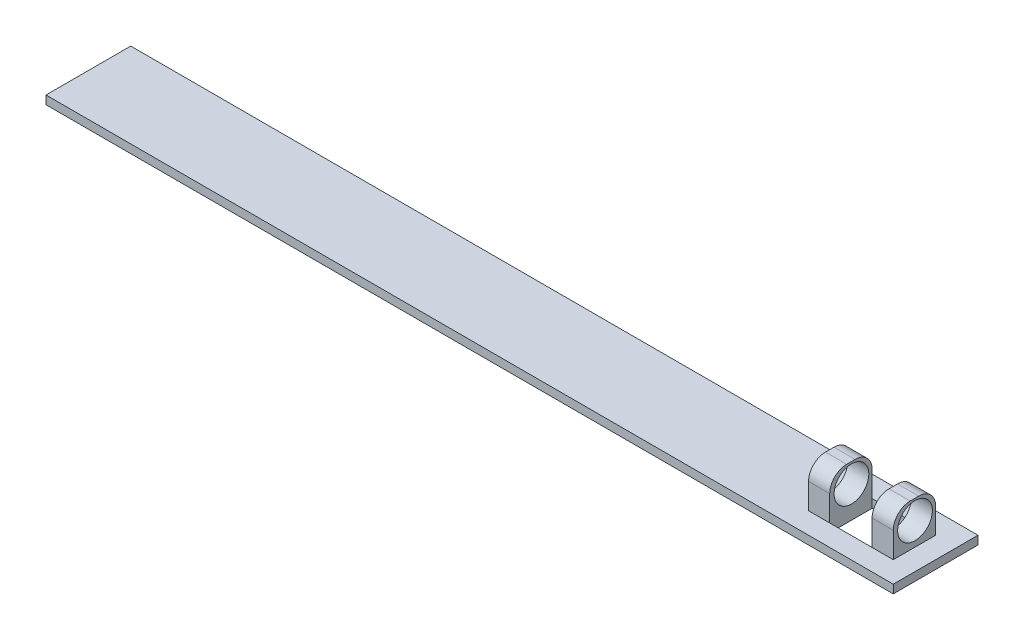
ISO-10303-21;
HEADER;
FILE_DESCRIPTION(('STEP AP214'),'2;1');
FILE_NAME('part.step','',(''),(''),'','','');
FILE_SCHEMA(('AUTOMOTIVE_DESIGN { 1 0 10303 214 1 1 1 1 }'));
ENDSEC;
DATA;
#1=APPLICATION_CONTEXT('core data for automotive mechanical design processes');
#2=APPLICATION_PROTOCOL_DEFINITION('international standard','automotive_design',2000,#1);
#3=PRODUCT_CONTEXT('',#1,'mechanical');
#4=PRODUCT('Part','Part','',(#3));
#5=PRODUCT_RELATED_PRODUCT_CATEGORY('part','',(#4));
#6=PRODUCT_DEFINITION_FORMATION('','',#4);
#7=PRODUCT_DEFINITION_CONTEXT('part definition',#1,'design');
#8=PRODUCT_DEFINITION('design','',#6,#7);
#9=PRODUCT_DEFINITION_SHAPE('','',#8);
#10=(LENGTH_UNIT() NAMED_UNIT(*) SI_UNIT(.MILLI.,.METRE.));
#11=(NAMED_UNIT(*) PLANE_ANGLE_UNIT() SI_UNIT($,.RADIAN.));
#12=(NAMED_UNIT(*) SI_UNIT($,.STERADIAN.) SOLID_ANGLE_UNIT());
#13=UNCERTAINTY_MEASURE_WITH_UNIT(LENGTH_MEASURE(1.E-05),#10,'distance_accuracy_value','');
#14=(GEOMETRIC_REPRESENTATION_CONTEXT(3) GLOBAL_UNCERTAINTY_ASSIGNED_CONTEXT((#13)) GLOBAL_UNIT_ASSIGNED_CONTEXT((#10,
#11,#12)) REPRESENTATION_CONTEXT('',''));
#15=CARTESIAN_POINT('',(0.,0.,0.));
#16=DIRECTION('',(0.,0.,1.));
#17=DIRECTION('',(1.,0.,0.));
#18=AXIS2_PLACEMENT_3D('',#15,#16,#17);
#19=CARTESIAN_POINT('',(0.,0.,0.));
#20=DIRECTION('',(0.,1.,0.));
#21=DIRECTION('',(0.,0.,1.));
#22=AXIS2_PLACEMENT_3D('',#19,#20,#21);
#23=PLANE('',#22);
#24=DIRECTION('',(1.,0.,0.));
#25=VECTOR('',#24,1.);
#26=CARTESIAN_POINT('',(0.,0.,0.));
#27=LINE('',#26,#25);
#28=CARTESIAN_POINT('',(0.,0.,0.));
#29=VERTEX_POINT('',#28);
#30=CARTESIAN_POINT('',(100.,0.,0.));
#31=VERTEX_POINT('',#30);
#32=EDGE_CURVE('E233',#29,#31,#27,.T.);
#33=ORIENTED_EDGE('',*,*,#32,.T.);
#34=DIRECTION('',(0.,0.,-1.));
#35=VECTOR('',#34,1.);
#36=CARTESIAN_POINT('',(100.,0.,0.));
#37=LINE('',#36,#35);
#38=CARTESIAN_POINT('',(100.,0.,-10.));
#39=VERTEX_POINT('',#38);
#40=EDGE_CURVE('E236',#31,#39,#37,.T.);
#41=ORIENTED_EDGE('',*,*,#40,.T.);
#42=DIRECTION('',(1.,0.,0.));
#43=VECTOR('',#42,1.);
#44=CARTESIAN_POINT('',(0.,0.,-10.));
#45=LINE('',#44,#43);
#46=CARTESIAN_POINT('',(0.,0.,-10.));
#47=VERTEX_POINT('',#46);
#48=EDGE_CURVE('E239',#47,#39,#45,.T.);
#49=ORIENTED_EDGE('',*,*,#48,.F.);
#50=DIRECTION('',(0.,0.,-1.));
#51=VECTOR('',#50,1.);
#52=CARTESIAN_POINT('',(0.,0.,0.));
#53=LINE('',#52,#51);
#54=EDGE_CURVE('E211',#29,#47,#53,.T.);
#55=ORIENTED_EDGE('',*,*,#54,.F.);
#56=EDGE_LOOP('',(#33,#41,#49,#55));
#57=FACE_BOUND('',#56,.T.);
#58=DIRECTION('',(0.,0.,-1.));
#59=VECTOR('',#58,1.);
#60=CARTESIAN_POINT('',(97.5,0.,0.));
#61=LINE('',#60,#59);
#62=CARTESIAN_POINT('',(97.5,0.,-2.5));
#63=VERTEX_POINT('',#62);
#64=CARTESIAN_POINT('',(97.5,0.,-7.5));
#65=VERTEX_POINT('',#64);
#66=EDGE_CURVE('E184',#63,#65,#61,.T.);
#67=ORIENTED_EDGE('',*,*,#66,.F.);
#68=DIRECTION('',(1.,0.,0.));
#69=VECTOR('',#68,1.);
#70=CARTESIAN_POINT('',(0.,0.,-2.5));
#71=LINE('',#70,#69);
#72=CARTESIAN_POINT('',(95.,0.,-2.5));
#73=VERTEX_POINT('',#72);
#74=EDGE_CURVE('E168',#73,#63,#71,.T.);
#75=ORIENTED_EDGE('',*,*,#74,.F.);
#76=DIRECTION('',(1.,0.,0.));
#77=VECTOR('',#76,1.);
#78=CARTESIAN_POINT('',(0.,0.,-2.5));
#79=LINE('',#78,#77);
#80=CARTESIAN_POINT('',(90.,0.,-2.5));
#81=VERTEX_POINT('',#80);
#82=EDGE_CURVE('E181',#81,#73,#79,.T.);
#83=ORIENTED_EDGE('',*,*,#82,.F.);
#84=CARTESIAN_POINT('',(87.5,0.,-2.5));
#85=VERTEX_POINT('',#84);
#86=EDGE_CURVE('E195',#85,#81,#79,.T.);
#87=ORIENTED_EDGE('',*,*,#86,.F.);
#88=DIRECTION('',(0.,0.,-1.));
#89=VECTOR('',#88,1.);
#90=CARTESIAN_POINT('',(87.5,0.,0.));
#91=LINE('',#90,#89);
#92=CARTESIAN_POINT('',(87.5,0.,-7.5));
#93=VERTEX_POINT('',#92);
#94=EDGE_CURVE('E226',#85,#93,#91,.T.);
#95=ORIENTED_EDGE('',*,*,#94,.T.);
#96=DIRECTION('',(1.,0.,0.));
#97=VECTOR('',#96,1.);
#98=CARTESIAN_POINT('',(0.,0.,-7.5));
#99=LINE('',#98,#97);
#100=CARTESIAN_POINT('',(90.,0.,-7.5));
#101=VERTEX_POINT('',#100);
#102=EDGE_CURVE('E230',#93,#101,#99,.T.);
#103=ORIENTED_EDGE('',*,*,#102,.T.);
#104=CARTESIAN_POINT('',(95.,0.,-7.5));
#105=VERTEX_POINT('',#104);
#106=EDGE_CURVE('E229',#101,#105,#99,.T.);
#107=ORIENTED_EDGE('',*,*,#106,.T.);
#108=DIRECTION('',(1.,0.,0.));
#109=VECTOR('',#108,1.);
#110=CARTESIAN_POINT('',(0.,0.,-7.5));
#111=LINE('',#110,#109);
#112=EDGE_CURVE('E323',#105,#65,#111,.T.);
#113=ORIENTED_EDGE('',*,*,#112,.T.);
#114=EDGE_LOOP('',(#67,#75,#83,#87,#95,#103,#107,#113));
#115=FACE_BOUND('',#114,.T.);
#116=ADVANCED_FACE('F38',(#57,#115),#23,.T.);
#117=CARTESIAN_POINT('',(0.,-1.,-7.5));
#118=DIRECTION('',(0.,0.,1.));
#119=DIRECTION('',(1.,0.,0.));
#120=AXIS2_PLACEMENT_3D('',#117,#118,#119);
#121=PLANE('',#120);
#122=DIRECTION('',(1.,0.,0.));
#123=VECTOR('',#122,1.);
#124=CARTESIAN_POINT('',(0.,-1.,-7.5));
#125=LINE('',#124,#123);
#126=CARTESIAN_POINT('',(90.,-1.,-7.5));
#127=VERTEX_POINT('',#126);
#128=CARTESIAN_POINT('',(95.,-1.,-7.5));
#129=VERTEX_POINT('',#128);
#130=EDGE_CURVE('E210',#127,#129,#125,.T.);
#131=ORIENTED_EDGE('',*,*,#130,.T.);
#132=DIRECTION('',(0.,1.,0.));
#133=VECTOR('',#132,1.);
#134=CARTESIAN_POINT('',(95.,-1.,-7.5));
#135=LINE('',#134,#133);
#136=EDGE_CURVE('E196',#129,#105,#135,.T.);
#137=ORIENTED_EDGE('',*,*,#136,.T.);
#138=ORIENTED_EDGE('',*,*,#106,.F.);
#139=DIRECTION('',(0.,1.,0.));
#140=VECTOR('',#139,1.);
#141=CARTESIAN_POINT('',(90.,5.,-7.5));
#142=LINE('',#141,#140);
#143=EDGE_CURVE('E253',#127,#101,#142,.T.);
#144=ORIENTED_EDGE('',*,*,#143,.F.);
#145=EDGE_LOOP('',(#131,#137,#138,#144));
#146=FACE_BOUND('',#145,.T.);
#147=ADVANCED_FACE('F326',(#146),#121,.T.);
#148=CARTESIAN_POINT('',(0.,-1.,-2.5));
#149=DIRECTION('',(0.,0.,1.));
#150=DIRECTION('',(1.,0.,0.));
#151=AXIS2_PLACEMENT_3D('',#148,#149,#150);
#152=PLANE('',#151);
#153=DIRECTION('',(0.,1.,0.));
#154=VECTOR('',#153,1.);
#155=CARTESIAN_POINT('',(95.,-1.,-2.5));
#156=LINE('',#155,#154);
#157=CARTESIAN_POINT('',(95.,-1.,-2.5));
#158=VERTEX_POINT('',#157);
#159=EDGE_CURVE('E191',#158,#73,#156,.T.);
#160=ORIENTED_EDGE('',*,*,#159,.F.);
#161=DIRECTION('',(1.,0.,0.));
#162=VECTOR('',#161,1.);
#163=CARTESIAN_POINT('',(0.,-1.,-2.5));
#164=LINE('',#163,#162);
#165=CARTESIAN_POINT('',(90.,-1.,-2.5));
#166=VERTEX_POINT('',#165);
#167=EDGE_CURVE('E208',#166,#158,#164,.T.);
#168=ORIENTED_EDGE('',*,*,#167,.F.);
#169=DIRECTION('',(0.,1.,0.));
#170=VECTOR('',#169,1.);
#171=CARTESIAN_POINT('',(90.,5.,-2.5));
#172=LINE('',#171,#170);
#173=EDGE_CURVE('E194',#166,#81,#172,.T.);
#174=ORIENTED_EDGE('',*,*,#173,.T.);
#175=ORIENTED_EDGE('',*,*,#82,.T.);
#176=EDGE_LOOP('',(#160,#168,#174,#175));
#177=FACE_BOUND('',#176,.T.);
#178=ADVANCED_FACE('F189',(#177),#152,.F.);
#179=CARTESIAN_POINT('',(0.,5.,-2.5));
#180=DIRECTION('',(0.,0.,-1.));
#181=DIRECTION('',(-1.,0.,0.));
#182=AXIS2_PLACEMENT_3D('',#179,#180,#181);
#183=PLANE('',#182);
#184=DIRECTION('',(0.,-1.,0.));
#185=VECTOR('',#184,1.);
#186=CARTESIAN_POINT('',(90.,5.,-2.5));
#187=LINE('',#186,#185);
#188=CARTESIAN_POINT('',(90.,3.,-2.5));
#189=VERTEX_POINT('',#188);
#190=EDGE_CURVE('E268',#189,#81,#187,.T.);
#191=ORIENTED_EDGE('',*,*,#190,.F.);
#192=DIRECTION('',(1.,0.,0.));
#193=VECTOR('',#192,1.);
#194=CARTESIAN_POINT('',(87.5,3.,-2.5));
#195=LINE('',#194,#193);
#196=CARTESIAN_POINT('',(87.5,3.,-2.5));
#197=VERTEX_POINT('',#196);
#198=EDGE_CURVE('E11',#189,#197,#195,.F.);
#199=ORIENTED_EDGE('',*,*,#198,.T.);
#200=DIRECTION('',(0.,-1.,0.));
#201=VECTOR('',#200,1.);
#202=CARTESIAN_POINT('',(87.5,5.,-2.5));
#203=LINE('',#202,#201);
#204=EDGE_CURVE('E262',#197,#85,#203,.T.);
#205=ORIENTED_EDGE('',*,*,#204,.T.);
#206=ORIENTED_EDGE('',*,*,#86,.T.);
#207=EDGE_LOOP('',(#191,#199,#205,#206));
#208=FACE_BOUND('',#207,.T.);
#209=ADVANCED_FACE('F319',(#208),#183,.F.);
#210=CARTESIAN_POINT('',(90.,5.,0.));
#211=DIRECTION('',(-1.,0.,0.));
#212=DIRECTION('',(0.,0.,1.));
#213=AXIS2_PLACEMENT_3D('',#210,#211,#212);
#214=PLANE('',#213);
#215=CARTESIAN_POINT('',(90.,2.71010232238211,-5.06511355319716));
#216=DIRECTION('',(-1.,0.,0.));
#217=DIRECTION('',(0.,0.,1.));
#218=AXIS2_PLACEMENT_3D('',#215,#216,#217);
#219=CIRCLE('',#218,2.05);
#220=CARTESIAN_POINT('',(90.,2.71010232238211,-3.01511355319716));
#221=VERTEX_POINT('',#220);
#222=EDGE_CURVE('E185',#221,#221,#219,.T.);
#223=ORIENTED_EDGE('',*,*,#222,.T.);
#224=EDGE_LOOP('',(#223));
#225=FACE_BOUND('',#224,.T.);
#226=DIRECTION('',(0.,-1.,0.));
#227=VECTOR('',#226,1.);
#228=CARTESIAN_POINT('',(90.,5.,-7.5));
#229=LINE('',#228,#227);
#230=CARTESIAN_POINT('',(90.,3.,-7.5));
#231=VERTEX_POINT('',#230);
#232=EDGE_CURVE('E266',#231,#101,#229,.T.);
#233=ORIENTED_EDGE('',*,*,#232,.F.);
#234=CARTESIAN_POINT('',(90.,3.,-5.5));
#235=DIRECTION('',(-1.,0.,0.));
#236=DIRECTION('',(0.,0.,1.));
#237=AXIS2_PLACEMENT_3D('',#234,#235,#236);
#238=CIRCLE('',#237,2.);
#239=CARTESIAN_POINT('',(90.,5.,-5.5));
#240=VERTEX_POINT('',#239);
#241=EDGE_CURVE('E291',#231,#240,#238,.F.);
#242=ORIENTED_EDGE('',*,*,#241,.T.);
#243=DIRECTION('',(0.,0.,-1.));
#244=VECTOR('',#243,1.);
#245=CARTESIAN_POINT('',(90.,5.,0.));
#246=LINE('',#245,#244);
#247=CARTESIAN_POINT('',(90.,5.,-4.5));
#248=VERTEX_POINT('',#247);
#249=EDGE_CURVE('E258',#248,#240,#246,.T.);
#250=ORIENTED_EDGE('',*,*,#249,.F.);
#251=CARTESIAN_POINT('',(90.,3.,-4.5));
#252=DIRECTION('',(-1.,0.,0.));
#253=DIRECTION('',(0.,0.,1.));
#254=AXIS2_PLACEMENT_3D('',#251,#252,#253);
#255=CIRCLE('',#254,2.);
#256=EDGE_CURVE('E289',#248,#189,#255,.F.);
#257=ORIENTED_EDGE('',*,*,#256,.T.);
#258=ORIENTED_EDGE('',*,*,#190,.T.);
#259=ORIENTED_EDGE('',*,*,#173,.F.);
#260=DIRECTION('',(0.,0.,-1.));
#261=VECTOR('',#260,1.);
#262=CARTESIAN_POINT('',(90.,-1.,0.));
#263=LINE('',#262,#261);
#264=EDGE_CURVE('E256',#166,#127,#263,.T.);
#265=ORIENTED_EDGE('',*,*,#264,.T.);
#266=ORIENTED_EDGE('',*,*,#143,.T.);
#267=EDGE_LOOP('',(#233,#242,#250,#257,#258,#259,#265,#266));
#268=FACE_BOUND('',#267,.T.);
#269=ADVANCED_FACE('F314',(#225,#268),#214,.F.);
#270=CARTESIAN_POINT('',(0.,5.,-7.5));
#271=DIRECTION('',(0.,0.,-1.));
#272=DIRECTION('',(-1.,0.,0.));
#273=AXIS2_PLACEMENT_3D('',#270,#271,#272);
#274=PLANE('',#273);
#275=DIRECTION('',(0.,-1.,0.));
#276=VECTOR('',#275,1.);
#277=CARTESIAN_POINT('',(87.5,5.,-7.5));
#278=LINE('',#277,#276);
#279=CARTESIAN_POINT('',(87.5,3.,-7.5));
#280=VERTEX_POINT('',#279);
#281=EDGE_CURVE('E264',#280,#93,#278,.T.);
#282=ORIENTED_EDGE('',*,*,#281,.F.);
#283=DIRECTION('',(1.,0.,0.));
#284=VECTOR('',#283,1.);
#285=CARTESIAN_POINT('',(0.,3.,-7.5));
#286=LINE('',#285,#284);
#287=EDGE_CURVE('E286',#280,#231,#286,.T.);
#288=ORIENTED_EDGE('',*,*,#287,.T.);
#289=ORIENTED_EDGE('',*,*,#232,.T.);
#290=ORIENTED_EDGE('',*,*,#102,.F.);
#291=EDGE_LOOP('',(#282,#288,#289,#290));
#292=FACE_BOUND('',#291,.T.);
#293=ADVANCED_FACE('F309',(#292),#274,.T.);
#294=CARTESIAN_POINT('',(87.5,5.,0.));
#295=DIRECTION('',(-1.,0.,0.));
#296=DIRECTION('',(0.,0.,1.));
#297=AXIS2_PLACEMENT_3D('',#294,#295,#296);
#298=PLANE('',#297);
#299=CARTESIAN_POINT('',(87.5,2.71010232238211,-5.06511355319716));
#300=DIRECTION('',(-1.,0.,0.));
#301=DIRECTION('',(0.,0.,1.));
#302=AXIS2_PLACEMENT_3D('',#299,#300,#301);
#303=CIRCLE('',#302,2.05);
#304=CARTESIAN_POINT('',(87.5,2.71010232238211,-3.01511355319716));
#305=VERTEX_POINT('',#304);
#306=EDGE_CURVE('E361',#305,#305,#303,.T.);
#307=ORIENTED_EDGE('',*,*,#306,.F.);
#308=EDGE_LOOP('',(#307));
#309=FACE_BOUND('',#308,.T.);
#310=DIRECTION('',(0.,0.,-1.));
#311=VECTOR('',#310,1.);
#312=CARTESIAN_POINT('',(87.5,5.,0.));
#313=LINE('',#312,#311);
#314=CARTESIAN_POINT('',(87.5,5.,-4.5));
#315=VERTEX_POINT('',#314);
#316=CARTESIAN_POINT('',(87.5,5.,-5.5));
#317=VERTEX_POINT('',#316);
#318=EDGE_CURVE('E260',#315,#317,#313,.T.);
#319=ORIENTED_EDGE('',*,*,#318,.T.);
#320=CARTESIAN_POINT('',(87.5,3.,-5.5));
#321=DIRECTION('',(-1.,0.,0.));
#322=DIRECTION('',(0.,0.,1.));
#323=AXIS2_PLACEMENT_3D('',#320,#321,#322);
#324=CIRCLE('',#323,2.);
#325=EDGE_CURVE('E299',#317,#280,#324,.T.);
#326=ORIENTED_EDGE('',*,*,#325,.T.);
#327=ORIENTED_EDGE('',*,*,#281,.T.);
#328=ORIENTED_EDGE('',*,*,#94,.F.);
#329=ORIENTED_EDGE('',*,*,#204,.F.);
#330=CARTESIAN_POINT('',(87.5,3.,-4.5));
#331=DIRECTION('',(-1.,0.,0.));
#332=DIRECTION('',(0.,0.,1.));
#333=AXIS2_PLACEMENT_3D('',#330,#331,#332);
#334=CIRCLE('',#333,2.);
#335=EDGE_CURVE('E297',#197,#315,#334,.T.);
#336=ORIENTED_EDGE('',*,*,#335,.T.);
#337=EDGE_LOOP('',(#319,#326,#327,#328,#329,#336));
#338=FACE_BOUND('',#337,.T.);
#339=ADVANCED_FACE('F303',(#309,#338),#298,.T.);
#340=CARTESIAN_POINT('',(0.,5.,0.));
#341=DIRECTION('',(0.,1.,0.));
#342=DIRECTION('',(0.,0.,1.));
#343=AXIS2_PLACEMENT_3D('',#340,#341,#342);
#344=PLANE('',#343);
#345=ORIENTED_EDGE('',*,*,#249,.T.);
#346=DIRECTION('',(1.,0.,0.));
#347=VECTOR('',#346,1.);
#348=CARTESIAN_POINT('',(0.,5.,-5.5));
#349=LINE('',#348,#347);
#350=EDGE_CURVE('E59',#240,#317,#349,.F.);
#351=ORIENTED_EDGE('',*,*,#350,.T.);
#352=ORIENTED_EDGE('',*,*,#318,.F.);
#353=DIRECTION('',(1.,0.,0.));
#354=VECTOR('',#353,1.);
#355=CARTESIAN_POINT('',(90.,5.,-4.5));
#356=LINE('',#355,#354);
#357=EDGE_CURVE('E293',#315,#248,#356,.T.);
#358=ORIENTED_EDGE('',*,*,#357,.T.);
#359=EDGE_LOOP('',(#345,#351,#352,#358));
#360=FACE_BOUND('',#359,.T.);
#361=ADVANCED_FACE('F315',(#360),#344,.T.);
#362=CARTESIAN_POINT('',(0.,-1.,0.));
#363=DIRECTION('',(0.,1.,0.));
#364=DIRECTION('',(0.,0.,1.));
#365=AXIS2_PLACEMENT_3D('',#362,#363,#364);
#366=PLANE('',#365);
#367=ORIENTED_EDGE('',*,*,#130,.F.);
#368=ORIENTED_EDGE('',*,*,#264,.F.);
#369=ORIENTED_EDGE('',*,*,#167,.T.);
#370=DIRECTION('',(0.,0.,-1.));
#371=VECTOR('',#370,1.);
#372=CARTESIAN_POINT('',(95.,-1.,0.));
#373=LINE('',#372,#371);
#374=EDGE_CURVE('E174',#158,#129,#373,.T.);
#375=ORIENTED_EDGE('',*,*,#374,.T.);
#376=EDGE_LOOP('',(#367,#368,#369,#375));
#377=FACE_BOUND('',#376,.T.);
#378=DIRECTION('',(1.,0.,0.));
#379=VECTOR('',#378,1.);
#380=CARTESIAN_POINT('',(0.,-1.,0.));
#381=LINE('',#380,#379);
#382=CARTESIAN_POINT('',(0.,-1.,0.));
#383=VERTEX_POINT('',#382);
#384=CARTESIAN_POINT('',(100.,-1.,0.));
#385=VERTEX_POINT('',#384);
#386=EDGE_CURVE('E213',#383,#385,#381,.T.);
#387=ORIENTED_EDGE('',*,*,#386,.F.);
#388=DIRECTION('',(0.,0.,-1.));
#389=VECTOR('',#388,1.);
#390=CARTESIAN_POINT('',(0.,-1.,0.));
#391=LINE('',#390,#389);
#392=CARTESIAN_POINT('',(0.,-1.,-10.));
#393=VERTEX_POINT('',#392);
#394=EDGE_CURVE('E221',#383,#393,#391,.T.);
#395=ORIENTED_EDGE('',*,*,#394,.T.);
#396=DIRECTION('',(1.,0.,0.));
#397=VECTOR('',#396,1.);
#398=CARTESIAN_POINT('',(0.,-1.,-10.));
#399=LINE('',#398,#397);
#400=CARTESIAN_POINT('',(100.,-1.,-10.));
#401=VERTEX_POINT('',#400);
#402=EDGE_CURVE('E219',#393,#401,#399,.T.);
#403=ORIENTED_EDGE('',*,*,#402,.T.);
#404=DIRECTION('',(0.,0.,-1.));
#405=VECTOR('',#404,1.);
#406=CARTESIAN_POINT('',(100.,-1.,0.));
#407=LINE('',#406,#405);
#408=EDGE_CURVE('E216',#385,#401,#407,.T.);
#409=ORIENTED_EDGE('',*,*,#408,.F.);
#410=EDGE_LOOP('',(#387,#395,#403,#409));
#411=FACE_BOUND('',#410,.T.);
#412=ADVANCED_FACE('F405',(#377,#411),#366,.F.);
#413=CARTESIAN_POINT('',(0.,-1.,0.));
#414=DIRECTION('',(0.,0.,1.));
#415=DIRECTION('',(1.,0.,0.));
#416=AXIS2_PLACEMENT_3D('',#413,#414,#415);
#417=PLANE('',#416);
#418=ORIENTED_EDGE('',*,*,#32,.F.);
#419=DIRECTION('',(0.,1.,0.));
#420=VECTOR('',#419,1.);
#421=CARTESIAN_POINT('',(0.,-1.,0.));
#422=LINE('',#421,#420);
#423=EDGE_CURVE('E244',#383,#29,#422,.T.);
#424=ORIENTED_EDGE('',*,*,#423,.F.);
#425=ORIENTED_EDGE('',*,*,#386,.T.);
#426=DIRECTION('',(0.,1.,0.));
#427=VECTOR('',#426,1.);
#428=CARTESIAN_POINT('',(100.,-1.,0.));
#429=LINE('',#428,#427);
#430=EDGE_CURVE('E223',#385,#31,#429,.T.);
#431=ORIENTED_EDGE('',*,*,#430,.T.);
#432=EDGE_LOOP('',(#418,#424,#425,#431));
#433=FACE_BOUND('',#432,.T.);
#434=ADVANCED_FACE('F395',(#433),#417,.T.);
#435=CARTESIAN_POINT('',(0.,-1.,0.));
#436=DIRECTION('',(1.,0.,0.));
#437=DIRECTION('',(0.,0.,-1.));
#438=AXIS2_PLACEMENT_3D('',#435,#436,#437);
#439=PLANE('',#438);
#440=ORIENTED_EDGE('',*,*,#54,.T.);
#441=DIRECTION('',(0.,1.,0.));
#442=VECTOR('',#441,1.);
#443=CARTESIAN_POINT('',(0.,-1.,-10.));
#444=LINE('',#443,#442);
#445=EDGE_CURVE('E246',#393,#47,#444,.T.);
#446=ORIENTED_EDGE('',*,*,#445,.F.);
#447=ORIENTED_EDGE('',*,*,#394,.F.);
#448=ORIENTED_EDGE('',*,*,#423,.T.);
#449=EDGE_LOOP('',(#440,#446,#447,#448));
#450=FACE_BOUND('',#449,.T.);
#451=ADVANCED_FACE('F391',(#450),#439,.F.);
#452=CARTESIAN_POINT('',(0.,-1.,-10.));
#453=DIRECTION('',(0.,0.,1.));
#454=DIRECTION('',(1.,0.,0.));
#455=AXIS2_PLACEMENT_3D('',#452,#453,#454);
#456=PLANE('',#455);
#457=ORIENTED_EDGE('',*,*,#48,.T.);
#458=DIRECTION('',(0.,1.,0.));
#459=VECTOR('',#458,1.);
#460=CARTESIAN_POINT('',(100.,-1.,-10.));
#461=LINE('',#460,#459);
#462=EDGE_CURVE('E249',#401,#39,#461,.T.);
#463=ORIENTED_EDGE('',*,*,#462,.F.);
#464=ORIENTED_EDGE('',*,*,#402,.F.);
#465=ORIENTED_EDGE('',*,*,#445,.T.);
#466=EDGE_LOOP('',(#457,#463,#464,#465));
#467=FACE_BOUND('',#466,.T.);
#468=ADVANCED_FACE('F394',(#467),#456,.F.);
#469=CARTESIAN_POINT('',(100.,-1.,0.));
#470=DIRECTION('',(1.,0.,0.));
#471=DIRECTION('',(0.,0.,-1.));
#472=AXIS2_PLACEMENT_3D('',#469,#470,#471);
#473=PLANE('',#472);
#474=ORIENTED_EDGE('',*,*,#40,.F.);
#475=ORIENTED_EDGE('',*,*,#430,.F.);
#476=ORIENTED_EDGE('',*,*,#408,.T.);
#477=ORIENTED_EDGE('',*,*,#462,.T.);
#478=EDGE_LOOP('',(#474,#475,#476,#477));
#479=FACE_BOUND('',#478,.T.);
#480=ADVANCED_FACE('F399',(#479),#473,.T.);
#481=CARTESIAN_POINT('',(95.,-1.,0.));
#482=DIRECTION('',(1.,0.,0.));
#483=DIRECTION('',(0.,0.,-1.));
#484=AXIS2_PLACEMENT_3D('',#481,#482,#483);
#485=PLANE('',#484);
#486=CARTESIAN_POINT('',(95.,2.71010232238211,-5.06511355319716));
#487=DIRECTION('',(1.,0.,0.));
#488=DIRECTION('',(0.,0.,-1.));
#489=AXIS2_PLACEMENT_3D('',#486,#487,#488);
#490=CIRCLE('',#489,2.05);
#491=CARTESIAN_POINT('',(95.,2.71010232238211,-7.11511355319716));
#492=VERTEX_POINT('',#491);
#493=EDGE_CURVE('E364',#492,#492,#490,.T.);
#494=ORIENTED_EDGE('',*,*,#493,.T.);
#495=EDGE_LOOP('',(#494));
#496=FACE_BOUND('',#495,.T.);
#497=DIRECTION('',(0.,0.,-1.));
#498=VECTOR('',#497,1.);
#499=CARTESIAN_POINT('',(95.,5.,0.));
#500=LINE('',#499,#498);
#501=CARTESIAN_POINT('',(95.,5.,-4.5));
#502=VERTEX_POINT('',#501);
#503=CARTESIAN_POINT('',(95.,5.,-5.5));
#504=VERTEX_POINT('',#503);
#505=EDGE_CURVE('E338',#502,#504,#500,.T.);
#506=ORIENTED_EDGE('',*,*,#505,.T.);
#507=CARTESIAN_POINT('',(95.,3.,-5.5));
#508=DIRECTION('',(1.,0.,0.));
#509=DIRECTION('',(0.,0.,-1.));
#510=AXIS2_PLACEMENT_3D('',#507,#508,#509);
#511=CIRCLE('',#510,2.);
#512=CARTESIAN_POINT('',(95.,3.,-7.5));
#513=VERTEX_POINT('',#512);
#514=EDGE_CURVE('E284',#504,#513,#511,.F.);
#515=ORIENTED_EDGE('',*,*,#514,.T.);
#516=DIRECTION('',(0.,-1.,0.));
#517=VECTOR('',#516,1.);
#518=CARTESIAN_POINT('',(95.,5.,-7.5));
#519=LINE('',#518,#517);
#520=EDGE_CURVE('E329',#513,#105,#519,.T.);
#521=ORIENTED_EDGE('',*,*,#520,.T.);
#522=ORIENTED_EDGE('',*,*,#136,.F.);
#523=ORIENTED_EDGE('',*,*,#374,.F.);
#524=ORIENTED_EDGE('',*,*,#159,.T.);
#525=DIRECTION('',(0.,-1.,0.));
#526=VECTOR('',#525,1.);
#527=CARTESIAN_POINT('',(95.,5.,-2.5));
#528=LINE('',#527,#526);
#529=CARTESIAN_POINT('',(95.,3.,-2.5));
#530=VERTEX_POINT('',#529);
#531=EDGE_CURVE('E164',#530,#73,#528,.T.);
#532=ORIENTED_EDGE('',*,*,#531,.F.);
#533=CARTESIAN_POINT('',(95.,3.,-4.5));
#534=DIRECTION('',(1.,0.,0.));
#535=DIRECTION('',(0.,0.,-1.));
#536=AXIS2_PLACEMENT_3D('',#533,#534,#535);
#537=CIRCLE('',#536,2.);
#538=EDGE_CURVE('E282',#530,#502,#537,.F.);
#539=ORIENTED_EDGE('',*,*,#538,.T.);
#540=EDGE_LOOP('',(#506,#515,#521,#522,#523,#524,#532,#539));
#541=FACE_BOUND('',#540,.T.);
#542=ADVANCED_FACE('F200',(#496,#541),#485,.F.);
#543=CARTESIAN_POINT('',(0.,5.,-2.5));
#544=DIRECTION('',(0.,0.,-1.));
#545=DIRECTION('',(-1.,0.,0.));
#546=AXIS2_PLACEMENT_3D('',#543,#544,#545);
#547=PLANE('',#546);
#548=DIRECTION('',(0.,-1.,0.));
#549=VECTOR('',#548,1.);
#550=CARTESIAN_POINT('',(97.5,5.,-2.5));
#551=LINE('',#550,#549);
#552=CARTESIAN_POINT('',(97.5,3.,-2.5));
#553=VERTEX_POINT('',#552);
#554=EDGE_CURVE('E175',#553,#63,#551,.T.);
#555=ORIENTED_EDGE('',*,*,#554,.F.);
#556=DIRECTION('',(1.,0.,0.));
#557=VECTOR('',#556,1.);
#558=CARTESIAN_POINT('',(95.,3.,-2.5));
#559=LINE('',#558,#557);
#560=EDGE_CURVE('E46',#553,#530,#559,.F.);
#561=ORIENTED_EDGE('',*,*,#560,.T.);
#562=ORIENTED_EDGE('',*,*,#531,.T.);
#563=ORIENTED_EDGE('',*,*,#74,.T.);
#564=EDGE_LOOP('',(#555,#561,#562,#563));
#565=FACE_BOUND('',#564,.T.);
#566=ADVANCED_FACE('F167',(#565),#547,.F.);
#567=CARTESIAN_POINT('',(97.5,5.,0.));
#568=DIRECTION('',(-1.,0.,0.));
#569=DIRECTION('',(0.,0.,1.));
#570=AXIS2_PLACEMENT_3D('',#567,#568,#569);
#571=PLANE('',#570);
#572=CARTESIAN_POINT('',(97.5,2.71010232238211,-5.06511355319716));
#573=DIRECTION('',(1.,0.,0.));
#574=DIRECTION('',(0.,0.,-1.));
#575=AXIS2_PLACEMENT_3D('',#572,#573,#574);
#576=CIRCLE('',#575,2.05);
#577=CARTESIAN_POINT('',(97.5,2.71010232238211,-7.11511355319716));
#578=VERTEX_POINT('',#577);
#579=EDGE_CURVE('E367',#578,#578,#576,.T.);
#580=ORIENTED_EDGE('',*,*,#579,.F.);
#581=EDGE_LOOP('',(#580));
#582=FACE_BOUND('',#581,.T.);
#583=DIRECTION('',(0.,-1.,0.));
#584=VECTOR('',#583,1.);
#585=CARTESIAN_POINT('',(97.5,5.,-7.5));
#586=LINE('',#585,#584);
#587=CARTESIAN_POINT('',(97.5,3.,-7.5));
#588=VERTEX_POINT('',#587);
#589=EDGE_CURVE('E333',#588,#65,#586,.T.);
#590=ORIENTED_EDGE('',*,*,#589,.F.);
#591=CARTESIAN_POINT('',(97.5,3.,-5.5));
#592=DIRECTION('',(-1.,0.,0.));
#593=DIRECTION('',(0.,0.,1.));
#594=AXIS2_PLACEMENT_3D('',#591,#592,#593);
#595=CIRCLE('',#594,2.);
#596=CARTESIAN_POINT('',(97.5,5.,-5.5));
#597=VERTEX_POINT('',#596);
#598=EDGE_CURVE('E275',#588,#597,#595,.F.);
#599=ORIENTED_EDGE('',*,*,#598,.T.);
#600=DIRECTION('',(0.,0.,-1.));
#601=VECTOR('',#600,1.);
#602=CARTESIAN_POINT('',(97.5,5.,0.));
#603=LINE('',#602,#601);
#604=CARTESIAN_POINT('',(97.5,5.,-4.5));
#605=VERTEX_POINT('',#604);
#606=EDGE_CURVE('E334',#605,#597,#603,.T.);
#607=ORIENTED_EDGE('',*,*,#606,.F.);
#608=CARTESIAN_POINT('',(97.5,3.,-4.5));
#609=DIRECTION('',(-1.,0.,0.));
#610=DIRECTION('',(0.,0.,1.));
#611=AXIS2_PLACEMENT_3D('',#608,#609,#610);
#612=CIRCLE('',#611,2.);
#613=EDGE_CURVE('E273',#605,#553,#612,.F.);
#614=ORIENTED_EDGE('',*,*,#613,.T.);
#615=ORIENTED_EDGE('',*,*,#554,.T.);
#616=ORIENTED_EDGE('',*,*,#66,.T.);
#617=EDGE_LOOP('',(#590,#599,#607,#614,#615,#616));
#618=FACE_BOUND('',#617,.T.);
#619=ADVANCED_FACE('F345',(#582,#618),#571,.F.);
#620=CARTESIAN_POINT('',(0.,5.,-7.5));
#621=DIRECTION('',(0.,0.,-1.));
#622=DIRECTION('',(-1.,0.,0.));
#623=AXIS2_PLACEMENT_3D('',#620,#621,#622);
#624=PLANE('',#623);
#625=ORIENTED_EDGE('',*,*,#520,.F.);
#626=DIRECTION('',(1.,0.,0.));
#627=VECTOR('',#626,1.);
#628=CARTESIAN_POINT('',(0.,3.,-7.5));
#629=LINE('',#628,#627);
#630=EDGE_CURVE('E270',#513,#588,#629,.T.);
#631=ORIENTED_EDGE('',*,*,#630,.T.);
#632=ORIENTED_EDGE('',*,*,#589,.T.);
#633=ORIENTED_EDGE('',*,*,#112,.F.);
#634=EDGE_LOOP('',(#625,#631,#632,#633));
#635=FACE_BOUND('',#634,.T.);
#636=ADVANCED_FACE('F336',(#635),#624,.T.);
#637=CARTESIAN_POINT('',(0.,5.,0.));
#638=DIRECTION('',(0.,1.,0.));
#639=DIRECTION('',(0.,0.,1.));
#640=AXIS2_PLACEMENT_3D('',#637,#638,#639);
#641=PLANE('',#640);
#642=ORIENTED_EDGE('',*,*,#606,.T.);
#643=DIRECTION('',(1.,0.,0.));
#644=VECTOR('',#643,1.);
#645=CARTESIAN_POINT('',(0.,5.,-5.5));
#646=LINE('',#645,#644);
#647=EDGE_CURVE('E280',#597,#504,#646,.F.);
#648=ORIENTED_EDGE('',*,*,#647,.T.);
#649=ORIENTED_EDGE('',*,*,#505,.F.);
#650=DIRECTION('',(1.,0.,0.));
#651=VECTOR('',#650,1.);
#652=CARTESIAN_POINT('',(97.5,5.,-4.5));
#653=LINE('',#652,#651);
#654=EDGE_CURVE('E277',#502,#605,#653,.T.);
#655=ORIENTED_EDGE('',*,*,#654,.T.);
#656=EDGE_LOOP('',(#642,#648,#649,#655));
#657=FACE_BOUND('',#656,.T.);
#658=ADVANCED_FACE('F353',(#657),#641,.T.);
#659=CARTESIAN_POINT('',(0.,2.71010232238211,-5.06511355319716));
#660=DIRECTION('',(1.,0.,0.));
#661=DIRECTION('',(0.,0.,-1.));
#662=AXIS2_PLACEMENT_3D('',#659,#660,#661);
#663=CYLINDRICAL_SURFACE('',#662,2.05);
#664=ORIENTED_EDGE('',*,*,#579,.T.);
#665=EDGE_LOOP('',(#664));
#666=FACE_BOUND('',#665,.T.);
#667=ORIENTED_EDGE('',*,*,#493,.F.);
#668=EDGE_LOOP('',(#667));
#669=FACE_BOUND('',#668,.T.);
#670=ADVANCED_FACE('F371',(#666,#669),#663,.F.);
#671=ORIENTED_EDGE('',*,*,#306,.T.);
#672=EDGE_LOOP('',(#671));
#673=FACE_BOUND('',#672,.T.);
#674=ORIENTED_EDGE('',*,*,#222,.F.);
#675=EDGE_LOOP('',(#674));
#676=FACE_BOUND('',#675,.T.);
#677=ADVANCED_FACE('F427',(#673,#676),#663,.F.);
#678=CARTESIAN_POINT('',(0.,3.,-5.5));
#679=DIRECTION('',(1.,0.,0.));
#680=DIRECTION('',(0.,0.,-1.));
#681=AXIS2_PLACEMENT_3D('',#678,#679,#680);
#682=CYLINDRICAL_SURFACE('',#681,2.);
#683=ORIENTED_EDGE('',*,*,#514,.F.);
#684=ORIENTED_EDGE('',*,*,#647,.F.);
#685=ORIENTED_EDGE('',*,*,#598,.F.);
#686=ORIENTED_EDGE('',*,*,#630,.F.);
#687=EDGE_LOOP('',(#683,#684,#685,#686));
#688=FACE_BOUND('',#687,.T.);
#689=ADVANCED_FACE('F356',(#688),#682,.T.);
#690=CARTESIAN_POINT('',(0.,3.,-5.5));
#691=DIRECTION('',(1.,0.,0.));
#692=DIRECTION('',(0.,0.,-1.));
#693=AXIS2_PLACEMENT_3D('',#690,#691,#692);
#694=CYLINDRICAL_SURFACE('',#693,2.);
#695=ORIENTED_EDGE('',*,*,#325,.F.);
#696=ORIENTED_EDGE('',*,*,#350,.F.);
#697=ORIENTED_EDGE('',*,*,#241,.F.);
#698=ORIENTED_EDGE('',*,*,#287,.F.);
#699=EDGE_LOOP('',(#695,#696,#697,#698));
#700=FACE_BOUND('',#699,.T.);
#701=ADVANCED_FACE('F311',(#700),#694,.T.);
#702=CARTESIAN_POINT('',(0.,3.,-4.5));
#703=DIRECTION('',(-1.,0.,0.));
#704=DIRECTION('',(0.,0.,1.));
#705=AXIS2_PLACEMENT_3D('',#702,#703,#704);
#706=CYLINDRICAL_SURFACE('',#705,2.);
#707=ORIENTED_EDGE('',*,*,#538,.F.);
#708=ORIENTED_EDGE('',*,*,#560,.F.);
#709=ORIENTED_EDGE('',*,*,#613,.F.);
#710=ORIENTED_EDGE('',*,*,#654,.F.);
#711=EDGE_LOOP('',(#707,#708,#709,#710));
#712=FACE_BOUND('',#711,.T.);
#713=ADVANCED_FACE('F348',(#712),#706,.T.);
#714=CARTESIAN_POINT('',(0.,3.,-4.5));
#715=DIRECTION('',(-1.,0.,0.));
#716=DIRECTION('',(0.,0.,1.));
#717=AXIS2_PLACEMENT_3D('',#714,#715,#716);
#718=CYLINDRICAL_SURFACE('',#717,2.);
#719=ORIENTED_EDGE('',*,*,#335,.F.);
#720=ORIENTED_EDGE('',*,*,#198,.F.);
#721=ORIENTED_EDGE('',*,*,#256,.F.);
#722=ORIENTED_EDGE('',*,*,#357,.F.);
#723=EDGE_LOOP('',(#719,#720,#721,#722));
#724=FACE_BOUND('',#723,.T.);
#725=ADVANCED_FACE('F40',(#724),#718,.T.);
#726=CLOSED_SHELL('',(#116,#147,#178,#209,#269,#293,#339,#361,#412,#434,#451,#468,#480,#542,
#566,#619,#636,#658,#670,#677,#689,#701,#713,#725));
#727=MANIFOLD_SOLID_BREP('B2',#726);
#728=ADVANCED_BREP_SHAPE_REPRESENTATION('',(#18,#727),#14);
#729=SHAPE_DEFINITION_REPRESENTATION(#9,#728);
ENDSEC;
END-ISO-10303-21;
